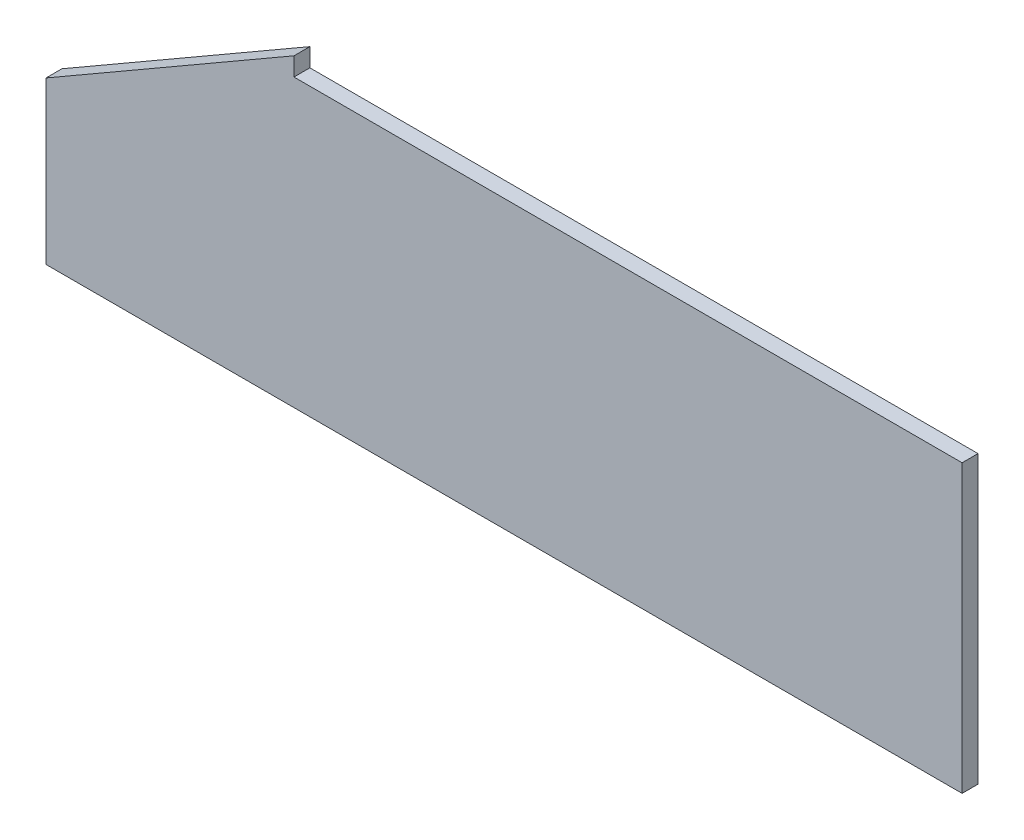
ISO-10303-21;
HEADER;
FILE_DESCRIPTION(('STEP AP214'),'2;1');
FILE_NAME('part.step','',(''),(''),'','','');
FILE_SCHEMA(('AUTOMOTIVE_DESIGN { 1 0 10303 214 1 1 1 1 }'));
ENDSEC;
DATA;
#1=APPLICATION_CONTEXT('core data for automotive mechanical design processes');
#2=APPLICATION_PROTOCOL_DEFINITION('international standard','automotive_design',2000,#1);
#3=PRODUCT_CONTEXT('',#1,'mechanical');
#4=PRODUCT('Part','Part','',(#3));
#5=PRODUCT_RELATED_PRODUCT_CATEGORY('part','',(#4));
#6=PRODUCT_DEFINITION_FORMATION('','',#4);
#7=PRODUCT_DEFINITION_CONTEXT('part definition',#1,'design');
#8=PRODUCT_DEFINITION('design','',#6,#7);
#9=PRODUCT_DEFINITION_SHAPE('','',#8);
#10=(LENGTH_UNIT() NAMED_UNIT(*) SI_UNIT(.MILLI.,.METRE.));
#11=(NAMED_UNIT(*) PLANE_ANGLE_UNIT() SI_UNIT($,.RADIAN.));
#12=(NAMED_UNIT(*) SI_UNIT($,.STERADIAN.) SOLID_ANGLE_UNIT());
#13=UNCERTAINTY_MEASURE_WITH_UNIT(LENGTH_MEASURE(1.E-05),#10,'distance_accuracy_value','');
#14=(GEOMETRIC_REPRESENTATION_CONTEXT(3) GLOBAL_UNCERTAINTY_ASSIGNED_CONTEXT((#13)) GLOBAL_UNIT_ASSIGNED_CONTEXT((#10,
#11,#12)) REPRESENTATION_CONTEXT('',''));
#15=CARTESIAN_POINT('',(0.,0.,0.));
#16=DIRECTION('',(0.,0.,1.));
#17=DIRECTION('',(1.,0.,0.));
#18=AXIS2_PLACEMENT_3D('',#15,#16,#17);
#19=CARTESIAN_POINT('',(0.,101.549999999999,10.));
#20=DIRECTION('',(1.,0.,0.));
#21=DIRECTION('',(0.,1.,0.));
#22=AXIS2_PLACEMENT_3D('',#19,#20,#21);
#23=PLANE('',#22);
#24=DIRECTION('',(0.,-1.,0.));
#25=VECTOR('',#24,1.);
#26=CARTESIAN_POINT('',(0.,101.549999999999,0.));
#27=LINE('',#26,#25);
#28=CARTESIAN_POINT('',(0.,101.549999999999,0.));
#29=VERTEX_POINT('',#28);
#30=CARTESIAN_POINT('',(0.,0.,0.));
#31=VERTEX_POINT('',#30);
#32=EDGE_CURVE('E114',#29,#31,#27,.T.);
#33=ORIENTED_EDGE('',*,*,#32,.T.);
#34=DIRECTION('',(0.,0.,-1.));
#35=VECTOR('',#34,1.);
#36=CARTESIAN_POINT('',(0.,0.,10.));
#37=LINE('',#36,#35);
#38=CARTESIAN_POINT('',(0.,0.,10.));
#39=VERTEX_POINT('',#38);
#40=EDGE_CURVE('E11',#39,#31,#37,.T.);
#41=ORIENTED_EDGE('',*,*,#40,.F.);
#42=DIRECTION('',(0.,-1.,0.));
#43=VECTOR('',#42,1.);
#44=CARTESIAN_POINT('',(0.,101.549999999999,10.));
#45=LINE('',#44,#43);
#46=CARTESIAN_POINT('',(0.,101.549999999999,10.));
#47=VERTEX_POINT('',#46);
#48=EDGE_CURVE('E124',#47,#39,#45,.T.);
#49=ORIENTED_EDGE('',*,*,#48,.F.);
#50=DIRECTION('',(0.,0.,-1.));
#51=VECTOR('',#50,1.);
#52=CARTESIAN_POINT('',(0.,101.549999999999,10.));
#53=LINE('',#52,#51);
#54=EDGE_CURVE('E110',#47,#29,#53,.T.);
#55=ORIENTED_EDGE('',*,*,#54,.T.);
#56=EDGE_LOOP('',(#33,#41,#49,#55));
#57=FACE_BOUND('',#56,.T.);
#58=ADVANCED_FACE('F30',(#57),#23,.F.);
#59=CARTESIAN_POINT('',(0.,0.,10.));
#60=DIRECTION('',(0.,1.,0.));
#61=DIRECTION('',(0.,0.,1.));
#62=AXIS2_PLACEMENT_3D('',#59,#60,#61);
#63=PLANE('',#62);
#64=DIRECTION('',(1.,0.,0.));
#65=VECTOR('',#64,1.);
#66=CARTESIAN_POINT('',(0.,0.,0.));
#67=LINE('',#66,#65);
#68=CARTESIAN_POINT('',(575.884572681199,0.,0.));
#69=VERTEX_POINT('',#68);
#70=EDGE_CURVE('E117',#31,#69,#67,.T.);
#71=ORIENTED_EDGE('',*,*,#70,.T.);
#72=DIRECTION('',(0.,0.,-1.));
#73=VECTOR('',#72,1.);
#74=CARTESIAN_POINT('',(575.884572681199,0.,10.));
#75=LINE('',#74,#73);
#76=CARTESIAN_POINT('',(575.884572681199,0.,10.));
#77=VERTEX_POINT('',#76);
#78=EDGE_CURVE('E38',#77,#69,#75,.T.);
#79=ORIENTED_EDGE('',*,*,#78,.F.);
#80=DIRECTION('',(1.,0.,0.));
#81=VECTOR('',#80,1.);
#82=CARTESIAN_POINT('',(0.,0.,10.));
#83=LINE('',#82,#81);
#84=EDGE_CURVE('E83',#39,#77,#83,.T.);
#85=ORIENTED_EDGE('',*,*,#84,.F.);
#86=ORIENTED_EDGE('',*,*,#40,.T.);
#87=EDGE_LOOP('',(#71,#79,#85,#86));
#88=FACE_BOUND('',#87,.T.);
#89=ADVANCED_FACE('F148',(#88),#63,.F.);
#90=CARTESIAN_POINT('',(575.884572681199,180.,10.));
#91=DIRECTION('',(-1.,0.,0.));
#92=DIRECTION('',(0.,0.,1.));
#93=AXIS2_PLACEMENT_3D('',#90,#91,#92);
#94=PLANE('',#93);
#95=DIRECTION('',(0.,1.,0.));
#96=VECTOR('',#95,1.);
#97=CARTESIAN_POINT('',(575.884572681199,180.,0.));
#98=LINE('',#97,#96);
#99=CARTESIAN_POINT('',(575.884572681199,180.,0.));
#100=VERTEX_POINT('',#99);
#101=EDGE_CURVE('E119',#69,#100,#98,.T.);
#102=ORIENTED_EDGE('',*,*,#101,.T.);
#103=DIRECTION('',(0.,0.,-1.));
#104=VECTOR('',#103,1.);
#105=CARTESIAN_POINT('',(575.884572681199,180.,10.));
#106=LINE('',#105,#104);
#107=CARTESIAN_POINT('',(575.884572681199,180.,10.));
#108=VERTEX_POINT('',#107);
#109=EDGE_CURVE('E105',#108,#100,#106,.T.);
#110=ORIENTED_EDGE('',*,*,#109,.F.);
#111=DIRECTION('',(0.,1.,0.));
#112=VECTOR('',#111,1.);
#113=CARTESIAN_POINT('',(575.884572681199,180.,10.));
#114=LINE('',#113,#112);
#115=EDGE_CURVE('E96',#77,#108,#114,.T.);
#116=ORIENTED_EDGE('',*,*,#115,.F.);
#117=ORIENTED_EDGE('',*,*,#78,.T.);
#118=EDGE_LOOP('',(#102,#110,#116,#117));
#119=FACE_BOUND('',#118,.T.);
#120=ADVANCED_FACE('F130',(#119),#94,.F.);
#121=CARTESIAN_POINT('',(155.884572681198,180.,10.));
#122=DIRECTION('',(0.,-1.,0.));
#123=DIRECTION('',(0.,0.,-1.));
#124=AXIS2_PLACEMENT_3D('',#121,#122,#123);
#125=PLANE('',#124);
#126=DIRECTION('',(-1.,0.,0.));
#127=VECTOR('',#126,1.);
#128=CARTESIAN_POINT('',(155.884572681198,180.,0.));
#129=LINE('',#128,#127);
#130=CARTESIAN_POINT('',(155.884572681198,180.,0.));
#131=VERTEX_POINT('',#130);
#132=EDGE_CURVE('E104',#100,#131,#129,.T.);
#133=ORIENTED_EDGE('',*,*,#132,.T.);
#134=DIRECTION('',(0.,0.,-1.));
#135=VECTOR('',#134,1.);
#136=CARTESIAN_POINT('',(155.884572681198,180.,10.));
#137=LINE('',#136,#135);
#138=CARTESIAN_POINT('',(155.884572681198,180.,10.));
#139=VERTEX_POINT('',#138);
#140=EDGE_CURVE('E101',#139,#131,#137,.T.);
#141=ORIENTED_EDGE('',*,*,#140,.F.);
#142=DIRECTION('',(-1.,0.,0.));
#143=VECTOR('',#142,1.);
#144=CARTESIAN_POINT('',(155.884572681198,180.,10.));
#145=LINE('',#144,#143);
#146=EDGE_CURVE('E90',#108,#139,#145,.T.);
#147=ORIENTED_EDGE('',*,*,#146,.F.);
#148=ORIENTED_EDGE('',*,*,#109,.T.);
#149=EDGE_LOOP('',(#133,#141,#147,#148));
#150=FACE_BOUND('',#149,.T.);
#151=ADVANCED_FACE('F102',(#150),#125,.F.);
#152=CARTESIAN_POINT('',(155.884572681198,191.55,10.));
#153=DIRECTION('',(-1.,0.,0.));
#154=DIRECTION('',(0.,-1.,0.));
#155=AXIS2_PLACEMENT_3D('',#152,#153,#154);
#156=PLANE('',#155);
#157=DIRECTION('',(0.,1.,0.));
#158=VECTOR('',#157,1.);
#159=CARTESIAN_POINT('',(155.884572681198,191.55,0.));
#160=LINE('',#159,#158);
#161=CARTESIAN_POINT('',(155.884572681198,191.55,0.));
#162=VERTEX_POINT('',#161);
#163=EDGE_CURVE('E69',#131,#162,#160,.T.);
#164=ORIENTED_EDGE('',*,*,#163,.T.);
#165=DIRECTION('',(0.,0.,-1.));
#166=VECTOR('',#165,1.);
#167=CARTESIAN_POINT('',(155.884572681198,191.55,10.));
#168=LINE('',#167,#166);
#169=CARTESIAN_POINT('',(155.884572681198,191.55,10.));
#170=VERTEX_POINT('',#169);
#171=EDGE_CURVE('E106',#170,#162,#168,.T.);
#172=ORIENTED_EDGE('',*,*,#171,.F.);
#173=DIRECTION('',(0.,1.,0.));
#174=VECTOR('',#173,1.);
#175=CARTESIAN_POINT('',(155.884572681198,191.55,10.));
#176=LINE('',#175,#174);
#177=EDGE_CURVE('E94',#139,#170,#176,.T.);
#178=ORIENTED_EDGE('',*,*,#177,.F.);
#179=ORIENTED_EDGE('',*,*,#140,.T.);
#180=EDGE_LOOP('',(#164,#172,#178,#179));
#181=FACE_BOUND('',#180,.T.);
#182=ADVANCED_FACE('F108',(#181),#156,.F.);
#183=CARTESIAN_POINT('',(0.,101.549999999999,10.));
#184=DIRECTION('',(0.500000000000004,-0.866025403784436,0.));
#185=DIRECTION('',(0.866025403784436,0.500000000000004,0.));
#186=AXIS2_PLACEMENT_3D('',#183,#184,#185);
#187=PLANE('',#186);
#188=DIRECTION('',(-0.866025403784436,-0.500000000000004,0.));
#189=VECTOR('',#188,1.);
#190=CARTESIAN_POINT('',(0.,101.549999999999,0.));
#191=LINE('',#190,#189);
#192=EDGE_CURVE('E75',#162,#29,#191,.T.);
#193=ORIENTED_EDGE('',*,*,#192,.T.);
#194=ORIENTED_EDGE('',*,*,#54,.F.);
#195=DIRECTION('',(-0.866025403784436,-0.500000000000004,0.));
#196=VECTOR('',#195,1.);
#197=CARTESIAN_POINT('',(0.,101.549999999999,10.));
#198=LINE('',#197,#196);
#199=EDGE_CURVE('E46',#170,#47,#198,.T.);
#200=ORIENTED_EDGE('',*,*,#199,.F.);
#201=ORIENTED_EDGE('',*,*,#171,.T.);
#202=EDGE_LOOP('',(#193,#194,#200,#201));
#203=FACE_BOUND('',#202,.T.);
#204=ADVANCED_FACE('F137',(#203),#187,.F.);
#205=CARTESIAN_POINT('',(0.,0.,10.));
#206=DIRECTION('',(0.,0.,1.));
#207=DIRECTION('',(1.,0.,0.));
#208=AXIS2_PLACEMENT_3D('',#205,#206,#207);
#209=PLANE('',#208);
#210=ORIENTED_EDGE('',*,*,#48,.T.);
#211=ORIENTED_EDGE('',*,*,#84,.T.);
#212=ORIENTED_EDGE('',*,*,#115,.T.);
#213=ORIENTED_EDGE('',*,*,#146,.T.);
#214=ORIENTED_EDGE('',*,*,#177,.T.);
#215=ORIENTED_EDGE('',*,*,#199,.T.);
#216=EDGE_LOOP('',(#210,#211,#212,#213,#214,#215));
#217=FACE_BOUND('',#216,.T.);
#218=ADVANCED_FACE('F92',(#217),#209,.T.);
#219=CARTESIAN_POINT('',(0.,0.,0.));
#220=DIRECTION('',(0.,0.,1.));
#221=DIRECTION('',(1.,0.,0.));
#222=AXIS2_PLACEMENT_3D('',#219,#220,#221);
#223=PLANE('',#222);
#224=ORIENTED_EDGE('',*,*,#32,.F.);
#225=ORIENTED_EDGE('',*,*,#192,.F.);
#226=ORIENTED_EDGE('',*,*,#163,.F.);
#227=ORIENTED_EDGE('',*,*,#132,.F.);
#228=ORIENTED_EDGE('',*,*,#101,.F.);
#229=ORIENTED_EDGE('',*,*,#70,.F.);
#230=EDGE_LOOP('',(#224,#225,#226,#227,#228,#229));
#231=FACE_BOUND('',#230,.T.);
#232=ADVANCED_FACE('F133',(#231),#223,.F.);
#233=CLOSED_SHELL('',(#58,#89,#120,#151,#182,#204,#218,#232));
#234=MANIFOLD_SOLID_BREP('B2',#233);
#235=ADVANCED_BREP_SHAPE_REPRESENTATION('',(#18,#234),#14);
#236=SHAPE_DEFINITION_REPRESENTATION(#9,#235);
ENDSEC;
END-ISO-10303-21;
